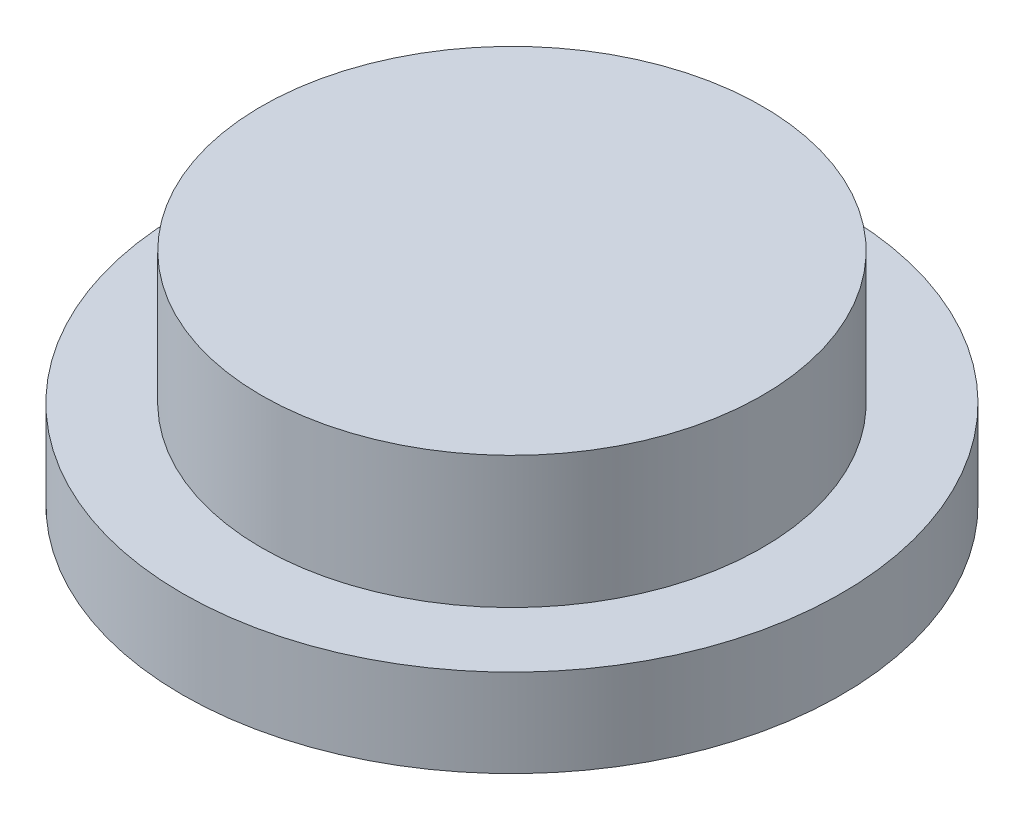
ISO-10303-21;
HEADER;
FILE_DESCRIPTION(('STEP AP214'),'2;1');
FILE_NAME('part.step','',(''),(''),'','','');
FILE_SCHEMA(('AUTOMOTIVE_DESIGN { 1 0 10303 214 1 1 1 1 }'));
ENDSEC;
DATA;
#1=APPLICATION_CONTEXT('core data for automotive mechanical design processes');
#2=APPLICATION_PROTOCOL_DEFINITION('international standard','automotive_design',2000,#1);
#3=PRODUCT_CONTEXT('',#1,'mechanical');
#4=PRODUCT('Part','Part','',(#3));
#5=PRODUCT_RELATED_PRODUCT_CATEGORY('part','',(#4));
#6=PRODUCT_DEFINITION_FORMATION('','',#4);
#7=PRODUCT_DEFINITION_CONTEXT('part definition',#1,'design');
#8=PRODUCT_DEFINITION('design','',#6,#7);
#9=PRODUCT_DEFINITION_SHAPE('','',#8);
#10=(LENGTH_UNIT() NAMED_UNIT(*) SI_UNIT(.MILLI.,.METRE.));
#11=(NAMED_UNIT(*) PLANE_ANGLE_UNIT() SI_UNIT($,.RADIAN.));
#12=(NAMED_UNIT(*) SI_UNIT($,.STERADIAN.) SOLID_ANGLE_UNIT());
#13=UNCERTAINTY_MEASURE_WITH_UNIT(LENGTH_MEASURE(1.E-05),#10,'distance_accuracy_value','');
#14=(GEOMETRIC_REPRESENTATION_CONTEXT(3) GLOBAL_UNCERTAINTY_ASSIGNED_CONTEXT((#13)) GLOBAL_UNIT_ASSIGNED_CONTEXT((#10,
#11,#12)) REPRESENTATION_CONTEXT('',''));
#15=CARTESIAN_POINT('',(0.,0.,0.));
#16=DIRECTION('',(0.,0.,1.));
#17=DIRECTION('',(1.,0.,0.));
#18=AXIS2_PLACEMENT_3D('',#15,#16,#17);
#19=CARTESIAN_POINT('',(0.,2.,0.));
#20=DIRECTION('',(0.,-1.,0.));
#21=DIRECTION('',(0.,0.,-1.));
#22=AXIS2_PLACEMENT_3D('',#19,#20,#21);
#23=CYLINDRICAL_SURFACE('',#22,7.5);
#24=CARTESIAN_POINT('',(0.,2.,0.));
#25=DIRECTION('',(0.,1.,0.));
#26=DIRECTION('',(0.,0.,1.));
#27=AXIS2_PLACEMENT_3D('',#24,#25,#26);
#28=CIRCLE('',#27,7.5);
#29=CARTESIAN_POINT('',(0.,2.,7.5));
#30=VERTEX_POINT('',#29);
#31=EDGE_CURVE('E45',#30,#30,#28,.T.);
#32=ORIENTED_EDGE('',*,*,#31,.F.);
#33=EDGE_LOOP('',(#32));
#34=FACE_BOUND('',#33,.T.);
#35=CARTESIAN_POINT('',(0.,0.,0.));
#36=DIRECTION('',(0.,1.,0.));
#37=DIRECTION('',(0.,0.,1.));
#38=AXIS2_PLACEMENT_3D('',#35,#36,#37);
#39=CIRCLE('',#38,7.5);
#40=CARTESIAN_POINT('',(0.,0.,7.5));
#41=VERTEX_POINT('',#40);
#42=EDGE_CURVE('E40',#41,#41,#39,.T.);
#43=ORIENTED_EDGE('',*,*,#42,.T.);
#44=EDGE_LOOP('',(#43));
#45=FACE_BOUND('',#44,.T.);
#46=ADVANCED_FACE('F37',(#34,#45),#23,.T.);
#47=CARTESIAN_POINT('',(0.,2.,0.));
#48=DIRECTION('',(0.,1.,0.));
#49=DIRECTION('',(0.,0.,1.));
#50=AXIS2_PLACEMENT_3D('',#47,#48,#49);
#51=PLANE('',#50);
#52=CARTESIAN_POINT('',(0.,2.,0.));
#53=DIRECTION('',(0.,1.,0.));
#54=DIRECTION('',(0.,0.,1.));
#55=AXIS2_PLACEMENT_3D('',#52,#53,#54);
#56=CIRCLE('',#55,5.7);
#57=CARTESIAN_POINT('',(0.,2.,5.7));
#58=VERTEX_POINT('',#57);
#59=EDGE_CURVE('E10',#58,#58,#56,.T.);
#60=ORIENTED_EDGE('',*,*,#59,.F.);
#61=EDGE_LOOP('',(#60));
#62=FACE_BOUND('',#61,.T.);
#63=ORIENTED_EDGE('',*,*,#31,.T.);
#64=EDGE_LOOP('',(#63));
#65=FACE_BOUND('',#64,.T.);
#66=ADVANCED_FACE('F65',(#62,#65),#51,.T.);
#67=CARTESIAN_POINT('',(0.,0.,0.));
#68=DIRECTION('',(0.,1.,0.));
#69=DIRECTION('',(0.,0.,1.));
#70=AXIS2_PLACEMENT_3D('',#67,#68,#69);
#71=PLANE('',#70);
#72=ORIENTED_EDGE('',*,*,#42,.F.);
#73=EDGE_LOOP('',(#72));
#74=FACE_BOUND('',#73,.T.);
#75=ADVANCED_FACE('F62',(#74),#71,.F.);
#76=CARTESIAN_POINT('',(0.,5.,0.));
#77=DIRECTION('',(0.,-1.,0.));
#78=DIRECTION('',(0.,0.,-1.));
#79=AXIS2_PLACEMENT_3D('',#76,#77,#78);
#80=CYLINDRICAL_SURFACE('',#79,5.7);
#81=CARTESIAN_POINT('',(0.,5.,0.));
#82=DIRECTION('',(0.,1.,0.));
#83=DIRECTION('',(0.,0.,1.));
#84=AXIS2_PLACEMENT_3D('',#81,#82,#83);
#85=CIRCLE('',#84,5.7);
#86=CARTESIAN_POINT('',(0.,5.,5.7));
#87=VERTEX_POINT('',#86);
#88=EDGE_CURVE('E52',#87,#87,#85,.T.);
#89=ORIENTED_EDGE('',*,*,#88,.F.);
#90=EDGE_LOOP('',(#89));
#91=FACE_BOUND('',#90,.T.);
#92=ORIENTED_EDGE('',*,*,#59,.T.);
#93=EDGE_LOOP('',(#92));
#94=FACE_BOUND('',#93,.T.);
#95=ADVANCED_FACE('F64',(#91,#94),#80,.T.);
#96=CARTESIAN_POINT('',(0.,5.,0.));
#97=DIRECTION('',(0.,1.,0.));
#98=DIRECTION('',(0.,0.,1.));
#99=AXIS2_PLACEMENT_3D('',#96,#97,#98);
#100=PLANE('',#99);
#101=ORIENTED_EDGE('',*,*,#88,.T.);
#102=EDGE_LOOP('',(#101));
#103=FACE_BOUND('',#102,.T.);
#104=ADVANCED_FACE('F70',(#103),#100,.T.);
#105=CLOSED_SHELL('',(#46,#66,#75,#95,#104));
#106=MANIFOLD_SOLID_BREP('B2',#105);
#107=ADVANCED_BREP_SHAPE_REPRESENTATION('',(#18,#106),#14);
#108=SHAPE_DEFINITION_REPRESENTATION(#9,#107);
ENDSEC;
END-ISO-10303-21;
